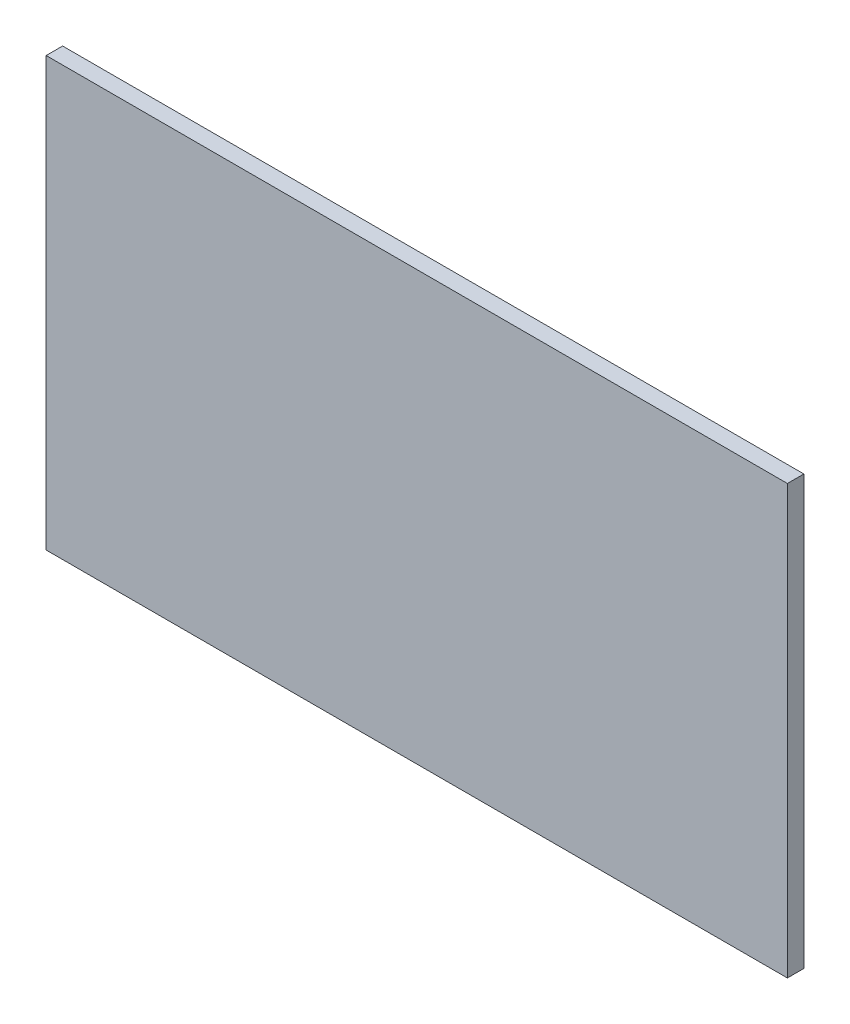
ISO-10303-21;
HEADER;
FILE_DESCRIPTION(('STEP AP214'),'2;1');
FILE_NAME('part.step','',(''),(''),'','','');
FILE_SCHEMA(('AUTOMOTIVE_DESIGN { 1 0 10303 214 1 1 1 1 }'));
ENDSEC;
DATA;
#1=APPLICATION_CONTEXT('core data for automotive mechanical design processes');
#2=APPLICATION_PROTOCOL_DEFINITION('international standard','automotive_design',2000,#1);
#3=PRODUCT_CONTEXT('',#1,'mechanical');
#4=PRODUCT('Part','Part','',(#3));
#5=PRODUCT_RELATED_PRODUCT_CATEGORY('part','',(#4));
#6=PRODUCT_DEFINITION_FORMATION('','',#4);
#7=PRODUCT_DEFINITION_CONTEXT('part definition',#1,'design');
#8=PRODUCT_DEFINITION('design','',#6,#7);
#9=PRODUCT_DEFINITION_SHAPE('','',#8);
#10=(LENGTH_UNIT() NAMED_UNIT(*) SI_UNIT(.MILLI.,.METRE.));
#11=(NAMED_UNIT(*) PLANE_ANGLE_UNIT() SI_UNIT($,.RADIAN.));
#12=(NAMED_UNIT(*) SI_UNIT($,.STERADIAN.) SOLID_ANGLE_UNIT());
#13=UNCERTAINTY_MEASURE_WITH_UNIT(LENGTH_MEASURE(1.E-05),#10,'distance_accuracy_value','');
#14=(GEOMETRIC_REPRESENTATION_CONTEXT(3) GLOBAL_UNCERTAINTY_ASSIGNED_CONTEXT((#13)) GLOBAL_UNIT_ASSIGNED_CONTEXT((#10,
#11,#12)) REPRESENTATION_CONTEXT('',''));
#15=CARTESIAN_POINT('',(0.,0.,0.));
#16=DIRECTION('',(0.,0.,1.));
#17=DIRECTION('',(1.,0.,0.));
#18=AXIS2_PLACEMENT_3D('',#15,#16,#17);
#19=CARTESIAN_POINT('',(0.5715,-0.3302,0.0254));
#20=DIRECTION('',(0.,0.,1.));
#21=DIRECTION('',(1.,0.,0.));
#22=AXIS2_PLACEMENT_3D('',#19,#20,#21);
#23=PLANE('',#22);
#24=DIRECTION('',(0.,1.,0.));
#25=VECTOR('',#24,1.);
#26=CARTESIAN_POINT('',(-0.5715,-0.3302,0.0254));
#27=LINE('',#26,#25);
#28=CARTESIAN_POINT('',(-0.5715,-0.3302,0.0254));
#29=VERTEX_POINT('',#28);
#30=CARTESIAN_POINT('',(-0.5715,0.3302,0.0254));
#31=VERTEX_POINT('',#30);
#32=EDGE_CURVE('E53',#29,#31,#27,.T.);
#33=ORIENTED_EDGE('',*,*,#32,.F.);
#34=DIRECTION('',(1.,0.,0.));
#35=VECTOR('',#34,1.);
#36=CARTESIAN_POINT('',(0.5715,-0.3302,0.0254));
#37=LINE('',#36,#35);
#38=CARTESIAN_POINT('',(0.5715,-0.3302,0.0254));
#39=VERTEX_POINT('',#38);
#40=EDGE_CURVE('E68',#39,#29,#37,.F.);
#41=ORIENTED_EDGE('',*,*,#40,.F.);
#42=DIRECTION('',(0.,1.,0.));
#43=VECTOR('',#42,1.);
#44=CARTESIAN_POINT('',(0.5715,0.3302,0.0254));
#45=LINE('',#44,#43);
#46=CARTESIAN_POINT('',(0.5715,0.3302,0.0254));
#47=VERTEX_POINT('',#46);
#48=EDGE_CURVE('E20',#47,#39,#45,.F.);
#49=ORIENTED_EDGE('',*,*,#48,.F.);
#50=DIRECTION('',(1.,0.,0.));
#51=VECTOR('',#50,1.);
#52=CARTESIAN_POINT('',(-0.5715,0.3302,0.0254));
#53=LINE('',#52,#51);
#54=EDGE_CURVE('E58',#31,#47,#53,.T.);
#55=ORIENTED_EDGE('',*,*,#54,.F.);
#56=EDGE_LOOP('',(#33,#41,#49,#55));
#57=FACE_BOUND('',#56,.T.);
#58=ADVANCED_FACE('F17',(#57),#23,.T.);
#59=CARTESIAN_POINT('',(0.5715,0.3302,0.));
#60=DIRECTION('',(1.,0.,0.));
#61=DIRECTION('',(0.,0.,-1.));
#62=AXIS2_PLACEMENT_3D('',#59,#60,#61);
#63=PLANE('',#62);
#64=DIRECTION('',(0.,0.,-1.));
#65=VECTOR('',#64,1.);
#66=CARTESIAN_POINT('',(0.5715,-0.3302,0.));
#67=LINE('',#66,#65);
#68=CARTESIAN_POINT('',(0.5715,-0.3302,0.));
#69=VERTEX_POINT('',#68);
#70=EDGE_CURVE('E79',#69,#39,#67,.F.);
#71=ORIENTED_EDGE('',*,*,#70,.F.);
#72=DIRECTION('',(0.,1.,0.));
#73=VECTOR('',#72,1.);
#74=CARTESIAN_POINT('',(0.5715,-0.3302,0.));
#75=LINE('',#74,#73);
#76=CARTESIAN_POINT('',(0.5715,0.3302,0.));
#77=VERTEX_POINT('',#76);
#78=EDGE_CURVE('E74',#69,#77,#75,.T.);
#79=ORIENTED_EDGE('',*,*,#78,.T.);
#80=DIRECTION('',(0.,0.,1.));
#81=VECTOR('',#80,1.);
#82=CARTESIAN_POINT('',(0.5715,0.3302,0.));
#83=LINE('',#82,#81);
#84=EDGE_CURVE('E63',#47,#77,#83,.F.);
#85=ORIENTED_EDGE('',*,*,#84,.F.);
#86=ORIENTED_EDGE('',*,*,#48,.T.);
#87=EDGE_LOOP('',(#71,#79,#85,#86));
#88=FACE_BOUND('',#87,.T.);
#89=ADVANCED_FACE('F73',(#88),#63,.T.);
#90=CARTESIAN_POINT('',(-0.5715,0.3302,0.));
#91=DIRECTION('',(0.,1.,0.));
#92=DIRECTION('',(0.,0.,1.));
#93=AXIS2_PLACEMENT_3D('',#90,#91,#92);
#94=PLANE('',#93);
#95=ORIENTED_EDGE('',*,*,#84,.T.);
#96=DIRECTION('',(1.,0.,0.));
#97=VECTOR('',#96,1.);
#98=CARTESIAN_POINT('',(0.5715,0.3302,0.));
#99=LINE('',#98,#97);
#100=CARTESIAN_POINT('',(-0.5715,0.3302,0.));
#101=VERTEX_POINT('',#100);
#102=EDGE_CURVE('E84',#77,#101,#99,.F.);
#103=ORIENTED_EDGE('',*,*,#102,.T.);
#104=DIRECTION('',(0.,0.,1.));
#105=VECTOR('',#104,1.);
#106=CARTESIAN_POINT('',(-0.5715,0.3302,0.));
#107=LINE('',#106,#105);
#108=EDGE_CURVE('E65',#31,#101,#107,.F.);
#109=ORIENTED_EDGE('',*,*,#108,.F.);
#110=ORIENTED_EDGE('',*,*,#54,.T.);
#111=EDGE_LOOP('',(#95,#103,#109,#110));
#112=FACE_BOUND('',#111,.T.);
#113=ADVANCED_FACE('F60',(#112),#94,.T.);
#114=CARTESIAN_POINT('',(-0.5715,-0.3302,0.));
#115=DIRECTION('',(-1.,0.,0.));
#116=DIRECTION('',(0.,0.,1.));
#117=AXIS2_PLACEMENT_3D('',#114,#115,#116);
#118=PLANE('',#117);
#119=ORIENTED_EDGE('',*,*,#108,.T.);
#120=DIRECTION('',(0.,1.,0.));
#121=VECTOR('',#120,1.);
#122=CARTESIAN_POINT('',(-0.5715,-0.3302,0.));
#123=LINE('',#122,#121);
#124=CARTESIAN_POINT('',(-0.5715,-0.3302,0.));
#125=VERTEX_POINT('',#124);
#126=EDGE_CURVE('E26',#101,#125,#123,.F.);
#127=ORIENTED_EDGE('',*,*,#126,.T.);
#128=DIRECTION('',(0.,0.,-1.));
#129=VECTOR('',#128,1.);
#130=CARTESIAN_POINT('',(-0.5715,-0.3302,0.));
#131=LINE('',#130,#129);
#132=EDGE_CURVE('E34',#29,#125,#131,.T.);
#133=ORIENTED_EDGE('',*,*,#132,.F.);
#134=ORIENTED_EDGE('',*,*,#32,.T.);
#135=EDGE_LOOP('',(#119,#127,#133,#134));
#136=FACE_BOUND('',#135,.T.);
#137=ADVANCED_FACE('F88',(#136),#118,.T.);
#138=CARTESIAN_POINT('',(0.5715,-0.3302,0.));
#139=DIRECTION('',(0.,-1.,0.));
#140=DIRECTION('',(0.,0.,-1.));
#141=AXIS2_PLACEMENT_3D('',#138,#139,#140);
#142=PLANE('',#141);
#143=ORIENTED_EDGE('',*,*,#132,.T.);
#144=DIRECTION('',(1.,0.,0.));
#145=VECTOR('',#144,1.);
#146=CARTESIAN_POINT('',(0.5715,-0.3302,0.));
#147=LINE('',#146,#145);
#148=EDGE_CURVE('E11',#125,#69,#147,.T.);
#149=ORIENTED_EDGE('',*,*,#148,.T.);
#150=ORIENTED_EDGE('',*,*,#70,.T.);
#151=ORIENTED_EDGE('',*,*,#40,.T.);
#152=EDGE_LOOP('',(#143,#149,#150,#151));
#153=FACE_BOUND('',#152,.T.);
#154=ADVANCED_FACE('F91',(#153),#142,.T.);
#155=CARTESIAN_POINT('',(0.5715,-0.3302,0.));
#156=DIRECTION('',(0.,0.,1.));
#157=DIRECTION('',(1.,0.,0.));
#158=AXIS2_PLACEMENT_3D('',#155,#156,#157);
#159=PLANE('',#158);
#160=ORIENTED_EDGE('',*,*,#126,.F.);
#161=ORIENTED_EDGE('',*,*,#102,.F.);
#162=ORIENTED_EDGE('',*,*,#78,.F.);
#163=ORIENTED_EDGE('',*,*,#148,.F.);
#164=EDGE_LOOP('',(#160,#161,#162,#163));
#165=FACE_BOUND('',#164,.T.);
#166=ADVANCED_FACE('F90',(#165),#159,.F.);
#167=CLOSED_SHELL('',(#58,#89,#113,#137,#154,#166));
#168=MANIFOLD_SOLID_BREP('B1',#167);
#169=ADVANCED_BREP_SHAPE_REPRESENTATION('',(#18,#168),#14);
#170=SHAPE_DEFINITION_REPRESENTATION(#9,#169);
ENDSEC;
END-ISO-10303-21;
